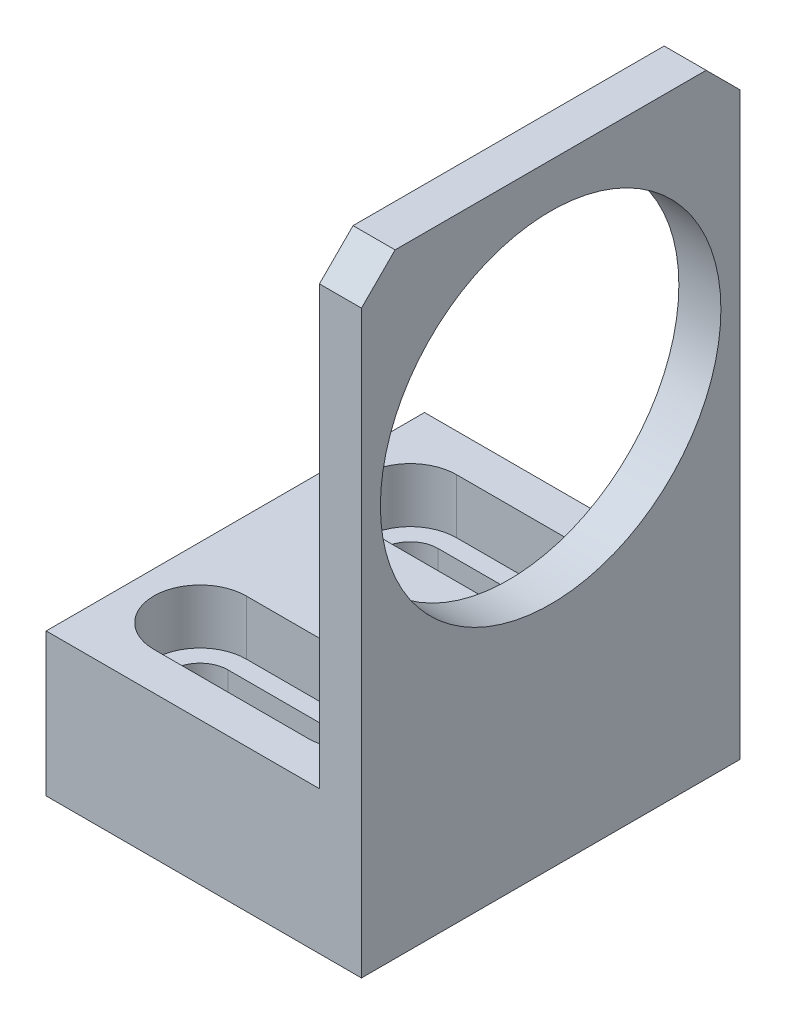
ISO-10303-21;
HEADER;
FILE_DESCRIPTION(('STEP AP214'),'2;1');
FILE_NAME('part.step','',(''),(''),'','','');
FILE_SCHEMA(('AUTOMOTIVE_DESIGN { 1 0 10303 214 1 1 1 1 }'));
ENDSEC;
DATA;
#1=APPLICATION_CONTEXT('core data for automotive mechanical design processes');
#2=APPLICATION_PROTOCOL_DEFINITION('international standard','automotive_design',2000,#1);
#3=PRODUCT_CONTEXT('',#1,'mechanical');
#4=PRODUCT('Part','Part','',(#3));
#5=PRODUCT_RELATED_PRODUCT_CATEGORY('part','',(#4));
#6=PRODUCT_DEFINITION_FORMATION('','',#4);
#7=PRODUCT_DEFINITION_CONTEXT('part definition',#1,'design');
#8=PRODUCT_DEFINITION('design','',#6,#7);
#9=PRODUCT_DEFINITION_SHAPE('','',#8);
#10=(LENGTH_UNIT() NAMED_UNIT(*) SI_UNIT(.MILLI.,.METRE.));
#11=(NAMED_UNIT(*) PLANE_ANGLE_UNIT() SI_UNIT($,.RADIAN.));
#12=(NAMED_UNIT(*) SI_UNIT($,.STERADIAN.) SOLID_ANGLE_UNIT());
#13=UNCERTAINTY_MEASURE_WITH_UNIT(LENGTH_MEASURE(1.E-05),#10,'distance_accuracy_value','');
#14=(GEOMETRIC_REPRESENTATION_CONTEXT(3) GLOBAL_UNCERTAINTY_ASSIGNED_CONTEXT((#13)) GLOBAL_UNIT_ASSIGNED_CONTEXT((#10,
#11,#12)) REPRESENTATION_CONTEXT('',''));
#15=CARTESIAN_POINT('',(0.,0.,0.));
#16=DIRECTION('',(0.,0.,1.));
#17=DIRECTION('',(1.,0.,0.));
#18=AXIS2_PLACEMENT_3D('',#15,#16,#17);
#19=CARTESIAN_POINT('',(0.,0.,0.));
#20=DIRECTION('',(-1.,0.,0.));
#21=DIRECTION('',(0.,0.,1.));
#22=AXIS2_PLACEMENT_3D('',#19,#20,#21);
#23=PLANE('',#22);
#24=CARTESIAN_POINT('',(0.,47.5,0.));
#25=DIRECTION('',(1.,0.,0.));
#26=DIRECTION('',(0.,0.,-1.));
#27=AXIS2_PLACEMENT_3D('',#24,#25,#26);
#28=CIRCLE('',#27,20.25);
#29=CARTESIAN_POINT('',(0.,47.5,-20.25));
#30=VERTEX_POINT('',#29);
#31=EDGE_CURVE('E464',#30,#30,#28,.T.);
#32=ORIENTED_EDGE('',*,*,#31,.T.);
#33=EDGE_LOOP('',(#32));
#34=FACE_BOUND('',#33,.T.);
#35=DIRECTION('',(0.,1.,0.));
#36=VECTOR('',#35,1.);
#37=CARTESIAN_POINT('',(0.,0.,-22.5));
#38=LINE('',#37,#36);
#39=CARTESIAN_POINT('',(0.,17.,-22.5));
#40=VERTEX_POINT('',#39);
#41=CARTESIAN_POINT('',(0.,69.,-22.5));
#42=VERTEX_POINT('',#41);
#43=EDGE_CURVE('E486',#40,#42,#38,.T.);
#44=ORIENTED_EDGE('',*,*,#43,.F.);
#45=DIRECTION('',(0.,0.,1.));
#46=VECTOR('',#45,1.);
#47=CARTESIAN_POINT('',(0.,17.,-22.5));
#48=LINE('',#47,#46);
#49=CARTESIAN_POINT('',(0.,17.,22.5));
#50=VERTEX_POINT('',#49);
#51=EDGE_CURVE('E446',#40,#50,#48,.T.);
#52=ORIENTED_EDGE('',*,*,#51,.T.);
#53=DIRECTION('',(0.,-1.,0.));
#54=VECTOR('',#53,1.);
#55=CARTESIAN_POINT('',(0.,0.,22.5));
#56=LINE('',#55,#54);
#57=CARTESIAN_POINT('',(0.,69.,22.5));
#58=VERTEX_POINT('',#57);
#59=EDGE_CURVE('E469',#58,#50,#56,.T.);
#60=ORIENTED_EDGE('',*,*,#59,.F.);
#61=DIRECTION('',(0.,-0.707106781186546,0.707106781186549));
#62=VECTOR('',#61,1.);
#63=CARTESIAN_POINT('',(0.,45.7500000000002,45.7499999999999));
#64=LINE('',#63,#62);
#65=CARTESIAN_POINT('',(0.,73.,18.5));
#66=VERTEX_POINT('',#65);
#67=EDGE_CURVE('E498',#58,#66,#64,.F.);
#68=ORIENTED_EDGE('',*,*,#67,.T.);
#69=DIRECTION('',(0.,0.,1.));
#70=VECTOR('',#69,1.);
#71=CARTESIAN_POINT('',(0.,73.,22.5));
#72=LINE('',#71,#70);
#73=CARTESIAN_POINT('',(0.,73.,-18.5));
#74=VERTEX_POINT('',#73);
#75=EDGE_CURVE('E475',#74,#66,#72,.T.);
#76=ORIENTED_EDGE('',*,*,#75,.F.);
#77=DIRECTION('',(0.,0.707106781186548,0.707106781186547));
#78=VECTOR('',#77,1.);
#79=CARTESIAN_POINT('',(0.,45.7499999999999,-45.75));
#80=LINE('',#79,#78);
#81=EDGE_CURVE('E500',#74,#42,#80,.F.);
#82=ORIENTED_EDGE('',*,*,#81,.T.);
#83=EDGE_LOOP('',(#44,#52,#60,#68,#76,#82));
#84=FACE_BOUND('',#83,.T.);
#85=ADVANCED_FACE('F187',(#34,#84),#23,.T.);
#86=CARTESIAN_POINT('',(5.,0.,0.));
#87=DIRECTION('',(-1.,0.,0.));
#88=DIRECTION('',(0.,0.,1.));
#89=AXIS2_PLACEMENT_3D('',#86,#87,#88);
#90=PLANE('',#89);
#91=DIRECTION('',(0.,1.,0.));
#92=VECTOR('',#91,1.);
#93=CARTESIAN_POINT('',(5.,0.,-22.5));
#94=LINE('',#93,#92);
#95=CARTESIAN_POINT('',(5.,0.,-22.5));
#96=VERTEX_POINT('',#95);
#97=CARTESIAN_POINT('',(5.,69.,-22.5));
#98=VERTEX_POINT('',#97);
#99=EDGE_CURVE('E477',#96,#98,#94,.T.);
#100=ORIENTED_EDGE('',*,*,#99,.T.);
#101=DIRECTION('',(0.,-0.707106781186548,-0.707106781186547));
#102=VECTOR('',#101,1.);
#103=CARTESIAN_POINT('',(5.,73.,-18.5));
#104=LINE('',#103,#102);
#105=CARTESIAN_POINT('',(5.,73.,-18.5));
#106=VERTEX_POINT('',#105);
#107=EDGE_CURVE('E507',#98,#106,#104,.F.);
#108=ORIENTED_EDGE('',*,*,#107,.T.);
#109=DIRECTION('',(0.,0.,1.));
#110=VECTOR('',#109,1.);
#111=CARTESIAN_POINT('',(5.,73.,22.5));
#112=LINE('',#111,#110);
#113=CARTESIAN_POINT('',(5.,73.,18.5));
#114=VERTEX_POINT('',#113);
#115=EDGE_CURVE('E480',#106,#114,#112,.T.);
#116=ORIENTED_EDGE('',*,*,#115,.T.);
#117=DIRECTION('',(0.,0.707106781186546,-0.707106781186549));
#118=VECTOR('',#117,1.);
#119=CARTESIAN_POINT('',(5.,69.,22.5));
#120=LINE('',#119,#118);
#121=CARTESIAN_POINT('',(5.,69.,22.5));
#122=VERTEX_POINT('',#121);
#123=EDGE_CURVE('E505',#114,#122,#120,.F.);
#124=ORIENTED_EDGE('',*,*,#123,.T.);
#125=DIRECTION('',(0.,-1.,0.));
#126=VECTOR('',#125,1.);
#127=CARTESIAN_POINT('',(5.,0.,22.5));
#128=LINE('',#127,#126);
#129=CARTESIAN_POINT('',(5.,0.,22.5));
#130=VERTEX_POINT('',#129);
#131=EDGE_CURVE('E472',#122,#130,#128,.T.);
#132=ORIENTED_EDGE('',*,*,#131,.T.);
#133=DIRECTION('',(0.,0.,-1.));
#134=VECTOR('',#133,1.);
#135=CARTESIAN_POINT('',(5.,0.,22.5));
#136=LINE('',#135,#134);
#137=EDGE_CURVE('E474',#130,#96,#136,.T.);
#138=ORIENTED_EDGE('',*,*,#137,.T.);
#139=EDGE_LOOP('',(#100,#108,#116,#124,#132,#138));
#140=FACE_BOUND('',#139,.T.);
#141=CARTESIAN_POINT('',(5.,47.5,0.));
#142=DIRECTION('',(1.,0.,0.));
#143=DIRECTION('',(0.,0.,-1.));
#144=AXIS2_PLACEMENT_3D('',#141,#142,#143);
#145=CIRCLE('',#144,20.25);
#146=CARTESIAN_POINT('',(5.,47.5,-20.25));
#147=VERTEX_POINT('',#146);
#148=EDGE_CURVE('E466',#147,#147,#145,.T.);
#149=ORIENTED_EDGE('',*,*,#148,.F.);
#150=EDGE_LOOP('',(#149));
#151=FACE_BOUND('',#150,.T.);
#152=ADVANCED_FACE('F571',(#140,#151),#90,.F.);
#153=CARTESIAN_POINT('',(5.,0.,22.5));
#154=DIRECTION('',(0.,0.,-1.));
#155=DIRECTION('',(-1.,0.,0.));
#156=AXIS2_PLACEMENT_3D('',#153,#154,#155);
#157=PLANE('',#156);
#158=ORIENTED_EDGE('',*,*,#131,.F.);
#159=DIRECTION('',(-1.,0.,0.));
#160=VECTOR('',#159,1.);
#161=CARTESIAN_POINT('',(5.,69.,22.5));
#162=LINE('',#161,#160);
#163=EDGE_CURVE('E509',#122,#58,#162,.T.);
#164=ORIENTED_EDGE('',*,*,#163,.T.);
#165=ORIENTED_EDGE('',*,*,#59,.T.);
#166=DIRECTION('',(1.,0.,0.));
#167=VECTOR('',#166,1.);
#168=CARTESIAN_POINT('',(-32.5,17.,22.5));
#169=LINE('',#168,#167);
#170=CARTESIAN_POINT('',(-32.5,17.,22.5));
#171=VERTEX_POINT('',#170);
#172=EDGE_CURVE('E462',#171,#50,#169,.T.);
#173=ORIENTED_EDGE('',*,*,#172,.F.);
#174=DIRECTION('',(0.,-1.,0.));
#175=VECTOR('',#174,1.);
#176=CARTESIAN_POINT('',(-32.5,17.,22.5));
#177=LINE('',#176,#175);
#178=CARTESIAN_POINT('',(-32.5,0.,22.5));
#179=VERTEX_POINT('',#178);
#180=EDGE_CURVE('E456',#171,#179,#177,.T.);
#181=ORIENTED_EDGE('',*,*,#180,.T.);
#182=DIRECTION('',(-1.,0.,0.));
#183=VECTOR('',#182,1.);
#184=CARTESIAN_POINT('',(5.,0.,22.5));
#185=LINE('',#184,#183);
#186=EDGE_CURVE('E491',#130,#179,#185,.T.);
#187=ORIENTED_EDGE('',*,*,#186,.F.);
#188=EDGE_LOOP('',(#158,#164,#165,#173,#181,#187));
#189=FACE_BOUND('',#188,.T.);
#190=ADVANCED_FACE('F577',(#189),#157,.F.);
#191=CARTESIAN_POINT('',(5.,0.,22.5));
#192=DIRECTION('',(0.,1.,0.));
#193=DIRECTION('',(0.,0.,1.));
#194=AXIS2_PLACEMENT_3D('',#191,#192,#193);
#195=PLANE('',#194);
#196=CARTESIAN_POINT('',(-5.8,0.,-12.5));
#197=DIRECTION('',(0.,1.,0.));
#198=DIRECTION('',(0.,0.,1.));
#199=AXIS2_PLACEMENT_3D('',#196,#197,#198);
#200=CIRCLE('',#199,3.3);
#201=CARTESIAN_POINT('',(-5.8,0.,-9.2));
#202=VERTEX_POINT('',#201);
#203=CARTESIAN_POINT('',(-5.8,0.,-15.8));
#204=VERTEX_POINT('',#203);
#205=EDGE_CURVE('E195',#202,#204,#200,.T.);
#206=ORIENTED_EDGE('',*,*,#205,.T.);
#207=DIRECTION('',(-1.,0.,0.));
#208=VECTOR('',#207,1.);
#209=CARTESIAN_POINT('',(5.,0.,-15.8));
#210=LINE('',#209,#208);
#211=CARTESIAN_POINT('',(-24.2,0.,-15.8));
#212=VERTEX_POINT('',#211);
#213=EDGE_CURVE('E13',#204,#212,#210,.T.);
#214=ORIENTED_EDGE('',*,*,#213,.T.);
#215=CARTESIAN_POINT('',(-24.2,0.,-12.5));
#216=DIRECTION('',(0.,1.,0.));
#217=DIRECTION('',(0.,0.,1.));
#218=AXIS2_PLACEMENT_3D('',#215,#216,#217);
#219=CIRCLE('',#218,3.3);
#220=CARTESIAN_POINT('',(-24.2,0.,-9.2));
#221=VERTEX_POINT('',#220);
#222=EDGE_CURVE('E527',#212,#221,#219,.T.);
#223=ORIENTED_EDGE('',*,*,#222,.T.);
#224=DIRECTION('',(1.,0.,0.));
#225=VECTOR('',#224,1.);
#226=CARTESIAN_POINT('',(5.,0.,-9.20000000000001));
#227=LINE('',#226,#225);
#228=EDGE_CURVE('E524',#221,#202,#227,.T.);
#229=ORIENTED_EDGE('',*,*,#228,.T.);
#230=EDGE_LOOP('',(#206,#214,#223,#229));
#231=FACE_BOUND('',#230,.T.);
#232=CARTESIAN_POINT('',(-5.8,0.,12.5));
#233=DIRECTION('',(0.,1.,0.));
#234=DIRECTION('',(0.,0.,1.));
#235=AXIS2_PLACEMENT_3D('',#232,#233,#234);
#236=CIRCLE('',#235,3.3);
#237=CARTESIAN_POINT('',(-5.8,0.,15.8));
#238=VERTEX_POINT('',#237);
#239=CARTESIAN_POINT('',(-5.8,0.,9.2));
#240=VERTEX_POINT('',#239);
#241=EDGE_CURVE('E518',#238,#240,#236,.T.);
#242=ORIENTED_EDGE('',*,*,#241,.T.);
#243=DIRECTION('',(-1.,0.,0.));
#244=VECTOR('',#243,1.);
#245=CARTESIAN_POINT('',(5.,0.,9.2));
#246=LINE('',#245,#244);
#247=CARTESIAN_POINT('',(-24.2,0.,9.2));
#248=VERTEX_POINT('',#247);
#249=EDGE_CURVE('E521',#240,#248,#246,.T.);
#250=ORIENTED_EDGE('',*,*,#249,.T.);
#251=CARTESIAN_POINT('',(-24.2,0.,12.5));
#252=DIRECTION('',(0.,1.,0.));
#253=DIRECTION('',(0.,0.,1.));
#254=AXIS2_PLACEMENT_3D('',#251,#252,#253);
#255=CIRCLE('',#254,3.3);
#256=CARTESIAN_POINT('',(-24.2,0.,15.8));
#257=VERTEX_POINT('',#256);
#258=EDGE_CURVE('E515',#248,#257,#255,.T.);
#259=ORIENTED_EDGE('',*,*,#258,.T.);
#260=DIRECTION('',(1.,0.,0.));
#261=VECTOR('',#260,1.);
#262=CARTESIAN_POINT('',(5.,0.,15.8));
#263=LINE('',#262,#261);
#264=EDGE_CURVE('E512',#257,#238,#263,.T.);
#265=ORIENTED_EDGE('',*,*,#264,.T.);
#266=EDGE_LOOP('',(#242,#250,#259,#265));
#267=FACE_BOUND('',#266,.T.);
#268=ORIENTED_EDGE('',*,*,#186,.T.);
#269=DIRECTION('',(0.,0.,-1.));
#270=VECTOR('',#269,1.);
#271=CARTESIAN_POINT('',(-32.5,0.,22.5));
#272=LINE('',#271,#270);
#273=CARTESIAN_POINT('',(-32.5,0.,-22.5));
#274=VERTEX_POINT('',#273);
#275=EDGE_CURVE('E447',#179,#274,#272,.T.);
#276=ORIENTED_EDGE('',*,*,#275,.T.);
#277=DIRECTION('',(-1.,0.,0.));
#278=VECTOR('',#277,1.);
#279=CARTESIAN_POINT('',(5.,0.,-22.5));
#280=LINE('',#279,#278);
#281=EDGE_CURVE('E483',#96,#274,#280,.T.);
#282=ORIENTED_EDGE('',*,*,#281,.F.);
#283=ORIENTED_EDGE('',*,*,#137,.F.);
#284=EDGE_LOOP('',(#268,#276,#282,#283));
#285=FACE_BOUND('',#284,.T.);
#286=ADVANCED_FACE('F531',(#231,#267,#285),#195,.F.);
#287=CARTESIAN_POINT('',(5.,0.,-22.5));
#288=DIRECTION('',(0.,0.,1.));
#289=DIRECTION('',(1.,0.,0.));
#290=AXIS2_PLACEMENT_3D('',#287,#288,#289);
#291=PLANE('',#290);
#292=ORIENTED_EDGE('',*,*,#281,.T.);
#293=DIRECTION('',(0.,1.,0.));
#294=VECTOR('',#293,1.);
#295=CARTESIAN_POINT('',(-32.5,0.,-22.5));
#296=LINE('',#295,#294);
#297=CARTESIAN_POINT('',(-32.5,17.,-22.5));
#298=VERTEX_POINT('',#297);
#299=EDGE_CURVE('E450',#274,#298,#296,.T.);
#300=ORIENTED_EDGE('',*,*,#299,.T.);
#301=DIRECTION('',(1.,0.,0.));
#302=VECTOR('',#301,1.);
#303=CARTESIAN_POINT('',(-32.5,17.,-22.5));
#304=LINE('',#303,#302);
#305=EDGE_CURVE('E459',#298,#40,#304,.T.);
#306=ORIENTED_EDGE('',*,*,#305,.T.);
#307=ORIENTED_EDGE('',*,*,#43,.T.);
#308=DIRECTION('',(1.,0.,0.));
#309=VECTOR('',#308,1.);
#310=CARTESIAN_POINT('',(5.,69.,-22.5));
#311=LINE('',#310,#309);
#312=EDGE_CURVE('E503',#42,#98,#311,.T.);
#313=ORIENTED_EDGE('',*,*,#312,.T.);
#314=ORIENTED_EDGE('',*,*,#99,.F.);
#315=EDGE_LOOP('',(#292,#300,#306,#307,#313,#314));
#316=FACE_BOUND('',#315,.T.);
#317=ADVANCED_FACE('F587',(#316),#291,.F.);
#318=CARTESIAN_POINT('',(5.,73.,22.5));
#319=DIRECTION('',(0.,-1.,0.));
#320=DIRECTION('',(0.,0.,-1.));
#321=AXIS2_PLACEMENT_3D('',#318,#319,#320);
#322=PLANE('',#321);
#323=ORIENTED_EDGE('',*,*,#115,.F.);
#324=DIRECTION('',(-1.,0.,0.));
#325=VECTOR('',#324,1.);
#326=CARTESIAN_POINT('',(5.,73.,-18.5));
#327=LINE('',#326,#325);
#328=EDGE_CURVE('E495',#106,#74,#327,.T.);
#329=ORIENTED_EDGE('',*,*,#328,.T.);
#330=ORIENTED_EDGE('',*,*,#75,.T.);
#331=DIRECTION('',(1.,0.,0.));
#332=VECTOR('',#331,1.);
#333=CARTESIAN_POINT('',(5.,73.,18.5));
#334=LINE('',#333,#332);
#335=EDGE_CURVE('E493',#66,#114,#334,.T.);
#336=ORIENTED_EDGE('',*,*,#335,.T.);
#337=EDGE_LOOP('',(#323,#329,#330,#336));
#338=FACE_BOUND('',#337,.T.);
#339=ADVANCED_FACE('F583',(#338),#322,.F.);
#340=CARTESIAN_POINT('',(5.,47.5,0.));
#341=DIRECTION('',(-1.,0.,0.));
#342=DIRECTION('',(0.,0.,1.));
#343=AXIS2_PLACEMENT_3D('',#340,#341,#342);
#344=CYLINDRICAL_SURFACE('',#343,20.25);
#345=ORIENTED_EDGE('',*,*,#148,.T.);
#346=EDGE_LOOP('',(#345));
#347=FACE_BOUND('',#346,.T.);
#348=ORIENTED_EDGE('',*,*,#31,.F.);
#349=EDGE_LOOP('',(#348));
#350=FACE_BOUND('',#349,.T.);
#351=ADVANCED_FACE('F586',(#347,#350),#344,.F.);
#352=CARTESIAN_POINT('',(5.,73.,-18.5));
#353=DIRECTION('',(0.,-0.707106781186547,0.707106781186548));
#354=DIRECTION('',(-1.,0.,0.));
#355=AXIS2_PLACEMENT_3D('',#352,#353,#354);
#356=PLANE('',#355);
#357=ORIENTED_EDGE('',*,*,#107,.F.);
#358=ORIENTED_EDGE('',*,*,#312,.F.);
#359=ORIENTED_EDGE('',*,*,#81,.F.);
#360=ORIENTED_EDGE('',*,*,#328,.F.);
#361=EDGE_LOOP('',(#357,#358,#359,#360));
#362=FACE_BOUND('',#361,.T.);
#363=ADVANCED_FACE('F596',(#362),#356,.F.);
#364=CARTESIAN_POINT('',(5.,69.,22.5));
#365=DIRECTION('',(0.,-0.707106781186549,-0.707106781186546));
#366=DIRECTION('',(-1.,0.,0.));
#367=AXIS2_PLACEMENT_3D('',#364,#365,#366);
#368=PLANE('',#367);
#369=ORIENTED_EDGE('',*,*,#123,.F.);
#370=ORIENTED_EDGE('',*,*,#335,.F.);
#371=ORIENTED_EDGE('',*,*,#67,.F.);
#372=ORIENTED_EDGE('',*,*,#163,.F.);
#373=EDGE_LOOP('',(#369,#370,#371,#372));
#374=FACE_BOUND('',#373,.T.);
#375=ADVANCED_FACE('F189',(#374),#368,.F.);
#376=CARTESIAN_POINT('',(-32.5,17.,-22.5));
#377=DIRECTION('',(0.,1.,0.));
#378=DIRECTION('',(0.,0.,1.));
#379=AXIS2_PLACEMENT_3D('',#376,#377,#378);
#380=PLANE('',#379);
#381=DIRECTION('',(1.,0.,0.));
#382=VECTOR('',#381,1.);
#383=CARTESIAN_POINT('',(-24.2,17.,-7.00000000000003));
#384=LINE('',#383,#382);
#385=CARTESIAN_POINT('',(-24.2,17.,-7.));
#386=VERTEX_POINT('',#385);
#387=CARTESIAN_POINT('',(-5.8,17.,-7.00000000000003));
#388=VERTEX_POINT('',#387);
#389=EDGE_CURVE('E548',#386,#388,#384,.T.);
#390=ORIENTED_EDGE('',*,*,#389,.F.);
#391=CARTESIAN_POINT('',(-24.2,17.,-12.5));
#392=DIRECTION('',(0.,1.,0.));
#393=DIRECTION('',(0.,0.,1.));
#394=AXIS2_PLACEMENT_3D('',#391,#392,#393);
#395=CIRCLE('',#394,5.5);
#396=CARTESIAN_POINT('',(-24.2,17.,-18.));
#397=VERTEX_POINT('',#396);
#398=EDGE_CURVE('E368',#397,#386,#395,.T.);
#399=ORIENTED_EDGE('',*,*,#398,.F.);
#400=DIRECTION('',(1.,0.,0.));
#401=VECTOR('',#400,1.);
#402=CARTESIAN_POINT('',(-24.2,17.,-18.));
#403=LINE('',#402,#401);
#404=CARTESIAN_POINT('',(-5.8,17.,-18.));
#405=VERTEX_POINT('',#404);
#406=EDGE_CURVE('E357',#397,#405,#403,.T.);
#407=ORIENTED_EDGE('',*,*,#406,.T.);
#408=CARTESIAN_POINT('',(-5.8,17.,-12.5));
#409=DIRECTION('',(0.,1.,0.));
#410=DIRECTION('',(0.,0.,1.));
#411=AXIS2_PLACEMENT_3D('',#408,#409,#410);
#412=CIRCLE('',#411,5.5);
#413=EDGE_CURVE('E381',#388,#405,#412,.T.);
#414=ORIENTED_EDGE('',*,*,#413,.F.);
#415=EDGE_LOOP('',(#390,#399,#407,#414));
#416=FACE_BOUND('',#415,.T.);
#417=DIRECTION('',(1.,0.,0.));
#418=VECTOR('',#417,1.);
#419=CARTESIAN_POINT('',(-24.2,17.,18.));
#420=LINE('',#419,#418);
#421=CARTESIAN_POINT('',(-24.2,17.,18.));
#422=VERTEX_POINT('',#421);
#423=CARTESIAN_POINT('',(-5.8,17.,18.));
#424=VERTEX_POINT('',#423);
#425=EDGE_CURVE('E392',#422,#424,#420,.T.);
#426=ORIENTED_EDGE('',*,*,#425,.F.);
#427=CARTESIAN_POINT('',(-24.2,17.,12.5));
#428=DIRECTION('',(0.,1.,0.));
#429=DIRECTION('',(0.,0.,1.));
#430=AXIS2_PLACEMENT_3D('',#427,#428,#429);
#431=CIRCLE('',#430,5.5);
#432=CARTESIAN_POINT('',(-24.2,17.,7.));
#433=VERTEX_POINT('',#432);
#434=EDGE_CURVE('E413',#433,#422,#431,.T.);
#435=ORIENTED_EDGE('',*,*,#434,.F.);
#436=DIRECTION('',(1.,0.,0.));
#437=VECTOR('',#436,1.);
#438=CARTESIAN_POINT('',(-24.2,17.,7.));
#439=LINE('',#438,#437);
#440=CARTESIAN_POINT('',(-5.8,17.,7.));
#441=VERTEX_POINT('',#440);
#442=EDGE_CURVE('E405',#433,#441,#439,.T.);
#443=ORIENTED_EDGE('',*,*,#442,.T.);
#444=CARTESIAN_POINT('',(-5.8,17.,12.5));
#445=DIRECTION('',(0.,1.,0.));
#446=DIRECTION('',(0.,0.,1.));
#447=AXIS2_PLACEMENT_3D('',#444,#445,#446);
#448=CIRCLE('',#447,5.5);
#449=EDGE_CURVE('E432',#424,#441,#448,.T.);
#450=ORIENTED_EDGE('',*,*,#449,.F.);
#451=EDGE_LOOP('',(#426,#435,#443,#450));
#452=FACE_BOUND('',#451,.T.);
#453=ORIENTED_EDGE('',*,*,#51,.F.);
#454=ORIENTED_EDGE('',*,*,#305,.F.);
#455=DIRECTION('',(0.,0.,1.));
#456=VECTOR('',#455,1.);
#457=CARTESIAN_POINT('',(-32.5,17.,-22.5));
#458=LINE('',#457,#456);
#459=EDGE_CURVE('E453',#298,#171,#458,.T.);
#460=ORIENTED_EDGE('',*,*,#459,.T.);
#461=ORIENTED_EDGE('',*,*,#172,.T.);
#462=EDGE_LOOP('',(#453,#454,#460,#461));
#463=FACE_BOUND('',#462,.T.);
#464=ADVANCED_FACE('F603',(#416,#452,#463),#380,.T.);
#465=CARTESIAN_POINT('',(-32.5,0.,0.));
#466=DIRECTION('',(1.,0.,0.));
#467=DIRECTION('',(0.,0.,-1.));
#468=AXIS2_PLACEMENT_3D('',#465,#466,#467);
#469=PLANE('',#468);
#470=ORIENTED_EDGE('',*,*,#275,.F.);
#471=ORIENTED_EDGE('',*,*,#180,.F.);
#472=ORIENTED_EDGE('',*,*,#459,.F.);
#473=ORIENTED_EDGE('',*,*,#299,.F.);
#474=EDGE_LOOP('',(#470,#471,#472,#473));
#475=FACE_BOUND('',#474,.T.);
#476=ADVANCED_FACE('F626',(#475),#469,.F.);
#477=CARTESIAN_POINT('',(-5.8,17.,12.5));
#478=DIRECTION('',(0.,1.,0.));
#479=DIRECTION('',(0.,0.,1.));
#480=AXIS2_PLACEMENT_3D('',#477,#478,#479);
#481=CYLINDRICAL_SURFACE('',#480,3.3);
#482=DIRECTION('',(0.,1.,0.));
#483=VECTOR('',#482,1.);
#484=CARTESIAN_POINT('',(-5.8,17.,15.8));
#485=LINE('',#484,#483);
#486=CARTESIAN_POINT('',(-5.8,10.5,15.8));
#487=VERTEX_POINT('',#486);
#488=EDGE_CURVE('E429',#487,#238,#485,.F.);
#489=ORIENTED_EDGE('',*,*,#488,.F.);
#490=CARTESIAN_POINT('',(-5.8,10.5,12.5));
#491=DIRECTION('',(0.,1.,0.));
#492=DIRECTION('',(0.,0.,1.));
#493=AXIS2_PLACEMENT_3D('',#490,#491,#492);
#494=CIRCLE('',#493,3.3);
#495=CARTESIAN_POINT('',(-5.8,10.5,9.2));
#496=VERTEX_POINT('',#495);
#497=EDGE_CURVE('E438',#487,#496,#494,.T.);
#498=ORIENTED_EDGE('',*,*,#497,.T.);
#499=DIRECTION('',(0.,1.,0.));
#500=VECTOR('',#499,1.);
#501=CARTESIAN_POINT('',(-5.8,17.,9.2));
#502=LINE('',#501,#500);
#503=EDGE_CURVE('E427',#240,#496,#502,.T.);
#504=ORIENTED_EDGE('',*,*,#503,.F.);
#505=ORIENTED_EDGE('',*,*,#241,.F.);
#506=EDGE_LOOP('',(#489,#498,#504,#505));
#507=FACE_BOUND('',#506,.T.);
#508=ADVANCED_FACE('F637',(#507),#481,.F.);
#509=CARTESIAN_POINT('',(-2.5,10.5,12.5));
#510=DIRECTION('',(0.,-1.,0.));
#511=DIRECTION('',(0.,0.,-1.));
#512=AXIS2_PLACEMENT_3D('',#509,#510,#511);
#513=PLANE('',#512);
#514=DIRECTION('',(1.,0.,0.));
#515=VECTOR('',#514,1.);
#516=CARTESIAN_POINT('',(-24.2,10.5,15.8));
#517=LINE('',#516,#515);
#518=CARTESIAN_POINT('',(-24.2,10.5,15.8));
#519=VERTEX_POINT('',#518);
#520=EDGE_CURVE('E397',#519,#487,#517,.T.);
#521=ORIENTED_EDGE('',*,*,#520,.F.);
#522=CARTESIAN_POINT('',(-24.2,10.5,12.5));
#523=DIRECTION('',(0.,1.,0.));
#524=DIRECTION('',(0.,0.,1.));
#525=AXIS2_PLACEMENT_3D('',#522,#523,#524);
#526=CIRCLE('',#525,3.3);
#527=CARTESIAN_POINT('',(-24.2,10.5,9.2));
#528=VERTEX_POINT('',#527);
#529=EDGE_CURVE('E419',#528,#519,#526,.T.);
#530=ORIENTED_EDGE('',*,*,#529,.F.);
#531=DIRECTION('',(1.,0.,0.));
#532=VECTOR('',#531,1.);
#533=CARTESIAN_POINT('',(-24.2,10.5,9.2));
#534=LINE('',#533,#532);
#535=EDGE_CURVE('E400',#528,#496,#534,.T.);
#536=ORIENTED_EDGE('',*,*,#535,.T.);
#537=ORIENTED_EDGE('',*,*,#497,.F.);
#538=EDGE_LOOP('',(#521,#530,#536,#537));
#539=FACE_BOUND('',#538,.T.);
#540=CARTESIAN_POINT('',(-5.8,10.5,12.5));
#541=DIRECTION('',(0.,1.,0.));
#542=DIRECTION('',(0.,0.,1.));
#543=AXIS2_PLACEMENT_3D('',#540,#541,#542);
#544=CIRCLE('',#543,5.5);
#545=CARTESIAN_POINT('',(-5.8,10.5,18.));
#546=VERTEX_POINT('',#545);
#547=CARTESIAN_POINT('',(-5.8,10.5,7.));
#548=VERTEX_POINT('',#547);
#549=EDGE_CURVE('E435',#546,#548,#544,.T.);
#550=ORIENTED_EDGE('',*,*,#549,.T.);
#551=DIRECTION('',(1.,0.,0.));
#552=VECTOR('',#551,1.);
#553=CARTESIAN_POINT('',(-24.2,10.5,7.));
#554=LINE('',#553,#552);
#555=CARTESIAN_POINT('',(-24.2,10.5,7.));
#556=VERTEX_POINT('',#555);
#557=EDGE_CURVE('E403',#556,#548,#554,.T.);
#558=ORIENTED_EDGE('',*,*,#557,.F.);
#559=CARTESIAN_POINT('',(-24.2,10.5,12.5));
#560=DIRECTION('',(0.,1.,0.));
#561=DIRECTION('',(0.,0.,1.));
#562=AXIS2_PLACEMENT_3D('',#559,#560,#561);
#563=CIRCLE('',#562,5.5);
#564=CARTESIAN_POINT('',(-24.2,10.5,18.));
#565=VERTEX_POINT('',#564);
#566=EDGE_CURVE('E416',#556,#565,#563,.T.);
#567=ORIENTED_EDGE('',*,*,#566,.T.);
#568=DIRECTION('',(1.,0.,0.));
#569=VECTOR('',#568,1.);
#570=CARTESIAN_POINT('',(-24.2,10.5,18.));
#571=LINE('',#570,#569);
#572=EDGE_CURVE('E394',#565,#546,#571,.T.);
#573=ORIENTED_EDGE('',*,*,#572,.T.);
#574=EDGE_LOOP('',(#550,#558,#567,#573));
#575=FACE_BOUND('',#574,.T.);
#576=ADVANCED_FACE('F644',(#539,#575),#513,.F.);
#577=CARTESIAN_POINT('',(-5.8,17.,12.5));
#578=DIRECTION('',(0.,1.,0.));
#579=DIRECTION('',(0.,0.,1.));
#580=AXIS2_PLACEMENT_3D('',#577,#578,#579);
#581=CYLINDRICAL_SURFACE('',#580,5.5);
#582=ORIENTED_EDGE('',*,*,#549,.F.);
#583=DIRECTION('',(0.,1.,0.));
#584=VECTOR('',#583,1.);
#585=CARTESIAN_POINT('',(-5.8,17.,18.));
#586=LINE('',#585,#584);
#587=EDGE_CURVE('E443',#424,#546,#586,.F.);
#588=ORIENTED_EDGE('',*,*,#587,.F.);
#589=ORIENTED_EDGE('',*,*,#449,.T.);
#590=DIRECTION('',(0.,1.,0.));
#591=VECTOR('',#590,1.);
#592=CARTESIAN_POINT('',(-5.8,17.,7.));
#593=LINE('',#592,#591);
#594=EDGE_CURVE('E441',#548,#441,#593,.T.);
#595=ORIENTED_EDGE('',*,*,#594,.F.);
#596=EDGE_LOOP('',(#582,#588,#589,#595));
#597=FACE_BOUND('',#596,.T.);
#598=ADVANCED_FACE('F648',(#597),#581,.F.);
#599=CARTESIAN_POINT('',(-24.2,17.,12.5));
#600=DIRECTION('',(0.,1.,0.));
#601=DIRECTION('',(0.,0.,1.));
#602=AXIS2_PLACEMENT_3D('',#599,#600,#601);
#603=CYLINDRICAL_SURFACE('',#602,3.3);
#604=DIRECTION('',(0.,1.,0.));
#605=VECTOR('',#604,1.);
#606=CARTESIAN_POINT('',(-24.2,17.,9.2));
#607=LINE('',#606,#605);
#608=EDGE_CURVE('E410',#528,#248,#607,.F.);
#609=ORIENTED_EDGE('',*,*,#608,.F.);
#610=ORIENTED_EDGE('',*,*,#529,.T.);
#611=DIRECTION('',(0.,1.,0.));
#612=VECTOR('',#611,1.);
#613=CARTESIAN_POINT('',(-24.2,17.,15.8));
#614=LINE('',#613,#612);
#615=EDGE_CURVE('E408',#257,#519,#614,.T.);
#616=ORIENTED_EDGE('',*,*,#615,.F.);
#617=ORIENTED_EDGE('',*,*,#258,.F.);
#618=EDGE_LOOP('',(#609,#610,#616,#617));
#619=FACE_BOUND('',#618,.T.);
#620=ADVANCED_FACE('F652',(#619),#603,.F.);
#621=CARTESIAN_POINT('',(-24.2,17.,12.5));
#622=DIRECTION('',(0.,1.,0.));
#623=DIRECTION('',(0.,0.,1.));
#624=AXIS2_PLACEMENT_3D('',#621,#622,#623);
#625=CYLINDRICAL_SURFACE('',#624,5.5);
#626=ORIENTED_EDGE('',*,*,#434,.T.);
#627=DIRECTION('',(0.,1.,0.));
#628=VECTOR('',#627,1.);
#629=CARTESIAN_POINT('',(-24.2,17.,18.));
#630=LINE('',#629,#628);
#631=EDGE_CURVE('E422',#565,#422,#630,.T.);
#632=ORIENTED_EDGE('',*,*,#631,.F.);
#633=ORIENTED_EDGE('',*,*,#566,.F.);
#634=DIRECTION('',(0.,1.,0.));
#635=VECTOR('',#634,1.);
#636=CARTESIAN_POINT('',(-24.2,17.,7.));
#637=LINE('',#636,#635);
#638=EDGE_CURVE('E424',#433,#556,#637,.F.);
#639=ORIENTED_EDGE('',*,*,#638,.F.);
#640=EDGE_LOOP('',(#626,#632,#633,#639));
#641=FACE_BOUND('',#640,.T.);
#642=ADVANCED_FACE('F656',(#641),#625,.F.);
#643=CARTESIAN_POINT('',(-24.2,17.,7.));
#644=DIRECTION('',(0.,0.,-1.));
#645=DIRECTION('',(-1.,0.,0.));
#646=AXIS2_PLACEMENT_3D('',#643,#644,#645);
#647=PLANE('',#646);
#648=ORIENTED_EDGE('',*,*,#594,.T.);
#649=ORIENTED_EDGE('',*,*,#442,.F.);
#650=ORIENTED_EDGE('',*,*,#638,.T.);
#651=ORIENTED_EDGE('',*,*,#557,.T.);
#652=EDGE_LOOP('',(#648,#649,#650,#651));
#653=FACE_BOUND('',#652,.T.);
#654=ADVANCED_FACE('F660',(#653),#647,.F.);
#655=CARTESIAN_POINT('',(-24.2,17.,9.2));
#656=DIRECTION('',(0.,0.,-1.));
#657=DIRECTION('',(-1.,0.,0.));
#658=AXIS2_PLACEMENT_3D('',#655,#656,#657);
#659=PLANE('',#658);
#660=ORIENTED_EDGE('',*,*,#503,.T.);
#661=ORIENTED_EDGE('',*,*,#535,.F.);
#662=ORIENTED_EDGE('',*,*,#608,.T.);
#663=ORIENTED_EDGE('',*,*,#249,.F.);
#664=EDGE_LOOP('',(#660,#661,#662,#663));
#665=FACE_BOUND('',#664,.T.);
#666=ADVANCED_FACE('F664',(#665),#659,.F.);
#667=CARTESIAN_POINT('',(-24.2,17.,15.8));
#668=DIRECTION('',(0.,0.,1.));
#669=DIRECTION('',(1.,0.,0.));
#670=AXIS2_PLACEMENT_3D('',#667,#668,#669);
#671=PLANE('',#670);
#672=ORIENTED_EDGE('',*,*,#615,.T.);
#673=ORIENTED_EDGE('',*,*,#520,.T.);
#674=ORIENTED_EDGE('',*,*,#488,.T.);
#675=ORIENTED_EDGE('',*,*,#264,.F.);
#676=EDGE_LOOP('',(#672,#673,#674,#675));
#677=FACE_BOUND('',#676,.T.);
#678=ADVANCED_FACE('F668',(#677),#671,.F.);
#679=CARTESIAN_POINT('',(-24.2,17.,18.));
#680=DIRECTION('',(0.,0.,1.));
#681=DIRECTION('',(1.,0.,0.));
#682=AXIS2_PLACEMENT_3D('',#679,#680,#681);
#683=PLANE('',#682);
#684=ORIENTED_EDGE('',*,*,#587,.T.);
#685=ORIENTED_EDGE('',*,*,#572,.F.);
#686=ORIENTED_EDGE('',*,*,#631,.T.);
#687=ORIENTED_EDGE('',*,*,#425,.T.);
#688=EDGE_LOOP('',(#684,#685,#686,#687));
#689=FACE_BOUND('',#688,.T.);
#690=ADVANCED_FACE('F568',(#689),#683,.F.);
#691=CARTESIAN_POINT('',(-5.8,17.,-12.5));
#692=DIRECTION('',(0.,1.,0.));
#693=DIRECTION('',(0.,0.,1.));
#694=AXIS2_PLACEMENT_3D('',#691,#692,#693);
#695=CYLINDRICAL_SURFACE('',#694,3.3);
#696=DIRECTION('',(0.,1.,0.));
#697=VECTOR('',#696,1.);
#698=CARTESIAN_POINT('',(-5.8,17.,-9.2));
#699=LINE('',#698,#697);
#700=CARTESIAN_POINT('',(-5.8,10.5,-9.2));
#701=VERTEX_POINT('',#700);
#702=EDGE_CURVE('E378',#701,#202,#699,.F.);
#703=ORIENTED_EDGE('',*,*,#702,.F.);
#704=CARTESIAN_POINT('',(-5.8,10.5,-12.5));
#705=DIRECTION('',(0.,1.,0.));
#706=DIRECTION('',(0.,0.,1.));
#707=AXIS2_PLACEMENT_3D('',#704,#705,#706);
#708=CIRCLE('',#707,3.3);
#709=CARTESIAN_POINT('',(-5.8,10.5,-15.8));
#710=VERTEX_POINT('',#709);
#711=EDGE_CURVE('E385',#701,#710,#708,.T.);
#712=ORIENTED_EDGE('',*,*,#711,.T.);
#713=DIRECTION('',(0.,1.,0.));
#714=VECTOR('',#713,1.);
#715=CARTESIAN_POINT('',(-5.8,17.,-15.8));
#716=LINE('',#715,#714);
#717=EDGE_CURVE('E210',#204,#710,#716,.T.);
#718=ORIENTED_EDGE('',*,*,#717,.F.);
#719=ORIENTED_EDGE('',*,*,#205,.F.);
#720=EDGE_LOOP('',(#703,#712,#718,#719));
#721=FACE_BOUND('',#720,.T.);
#722=ADVANCED_FACE('F534',(#721),#695,.F.);
#723=CARTESIAN_POINT('',(-2.5,10.5,-12.5));
#724=DIRECTION('',(0.,-1.,0.));
#725=DIRECTION('',(0.,0.,-1.));
#726=AXIS2_PLACEMENT_3D('',#723,#724,#725);
#727=PLANE('',#726);
#728=DIRECTION('',(1.,0.,0.));
#729=VECTOR('',#728,1.);
#730=CARTESIAN_POINT('',(-24.2,10.5,-9.2));
#731=LINE('',#730,#729);
#732=CARTESIAN_POINT('',(-24.2,10.5,-9.2));
#733=VERTEX_POINT('',#732);
#734=EDGE_CURVE('E540',#733,#701,#731,.T.);
#735=ORIENTED_EDGE('',*,*,#734,.F.);
#736=CARTESIAN_POINT('',(-24.2,10.5,-12.5));
#737=DIRECTION('',(0.,1.,0.));
#738=DIRECTION('',(0.,0.,1.));
#739=AXIS2_PLACEMENT_3D('',#736,#737,#738);
#740=CIRCLE('',#739,3.3);
#741=CARTESIAN_POINT('',(-24.2,10.5,-15.8));
#742=VERTEX_POINT('',#741);
#743=EDGE_CURVE('E367',#742,#733,#740,.T.);
#744=ORIENTED_EDGE('',*,*,#743,.F.);
#745=DIRECTION('',(1.,0.,0.));
#746=VECTOR('',#745,1.);
#747=CARTESIAN_POINT('',(-24.2,10.5,-15.8));
#748=LINE('',#747,#746);
#749=EDGE_CURVE('E358',#742,#710,#748,.T.);
#750=ORIENTED_EDGE('',*,*,#749,.T.);
#751=ORIENTED_EDGE('',*,*,#711,.F.);
#752=EDGE_LOOP('',(#735,#744,#750,#751));
#753=FACE_BOUND('',#752,.T.);
#754=CARTESIAN_POINT('',(-5.8,10.5,-12.5));
#755=DIRECTION('',(0.,1.,0.));
#756=DIRECTION('',(0.,0.,1.));
#757=AXIS2_PLACEMENT_3D('',#754,#755,#756);
#758=CIRCLE('',#757,5.5);
#759=CARTESIAN_POINT('',(-5.8,10.5,-7.));
#760=VERTEX_POINT('',#759);
#761=CARTESIAN_POINT('',(-5.8,10.5,-18.));
#762=VERTEX_POINT('',#761);
#763=EDGE_CURVE('E354',#760,#762,#758,.T.);
#764=ORIENTED_EDGE('',*,*,#763,.T.);
#765=DIRECTION('',(1.,0.,0.));
#766=VECTOR('',#765,1.);
#767=CARTESIAN_POINT('',(-24.2,10.5,-18.));
#768=LINE('',#767,#766);
#769=CARTESIAN_POINT('',(-24.2,10.5,-18.));
#770=VERTEX_POINT('',#769);
#771=EDGE_CURVE('E350',#770,#762,#768,.T.);
#772=ORIENTED_EDGE('',*,*,#771,.F.);
#773=CARTESIAN_POINT('',(-24.2,10.5,-12.5));
#774=DIRECTION('',(0.,1.,0.));
#775=DIRECTION('',(0.,0.,1.));
#776=AXIS2_PLACEMENT_3D('',#773,#774,#775);
#777=CIRCLE('',#776,5.5);
#778=CARTESIAN_POINT('',(-24.2,10.5,-7.));
#779=VERTEX_POINT('',#778);
#780=EDGE_CURVE('E353',#770,#779,#777,.T.);
#781=ORIENTED_EDGE('',*,*,#780,.T.);
#782=DIRECTION('',(1.,0.,0.));
#783=VECTOR('',#782,1.);
#784=CARTESIAN_POINT('',(-24.2,10.5,-7.));
#785=LINE('',#784,#783);
#786=EDGE_CURVE('E544',#779,#760,#785,.T.);
#787=ORIENTED_EDGE('',*,*,#786,.T.);
#788=EDGE_LOOP('',(#764,#772,#781,#787));
#789=FACE_BOUND('',#788,.T.);
#790=ADVANCED_FACE('F351',(#753,#789),#727,.F.);
#791=CARTESIAN_POINT('',(-5.8,17.,-12.5));
#792=DIRECTION('',(0.,1.,0.));
#793=DIRECTION('',(0.,0.,1.));
#794=AXIS2_PLACEMENT_3D('',#791,#792,#793);
#795=CYLINDRICAL_SURFACE('',#794,5.5);
#796=ORIENTED_EDGE('',*,*,#763,.F.);
#797=DIRECTION('',(0.,1.,0.));
#798=VECTOR('',#797,1.);
#799=CARTESIAN_POINT('',(-5.8,17.,-7.));
#800=LINE('',#799,#798);
#801=EDGE_CURVE('E389',#388,#760,#800,.F.);
#802=ORIENTED_EDGE('',*,*,#801,.F.);
#803=ORIENTED_EDGE('',*,*,#413,.T.);
#804=DIRECTION('',(0.,1.,0.));
#805=VECTOR('',#804,1.);
#806=CARTESIAN_POINT('',(-5.8,17.,-18.));
#807=LINE('',#806,#805);
#808=EDGE_CURVE('E387',#762,#405,#807,.T.);
#809=ORIENTED_EDGE('',*,*,#808,.F.);
#810=EDGE_LOOP('',(#796,#802,#803,#809));
#811=FACE_BOUND('',#810,.T.);
#812=ADVANCED_FACE('F560',(#811),#795,.F.);
#813=CARTESIAN_POINT('',(-24.2,17.,-12.5));
#814=DIRECTION('',(0.,1.,0.));
#815=DIRECTION('',(0.,0.,1.));
#816=AXIS2_PLACEMENT_3D('',#813,#814,#815);
#817=CYLINDRICAL_SURFACE('',#816,3.3);
#818=DIRECTION('',(0.,1.,0.));
#819=VECTOR('',#818,1.);
#820=CARTESIAN_POINT('',(-24.2,17.,-15.8));
#821=LINE('',#820,#819);
#822=EDGE_CURVE('E372',#742,#212,#821,.F.);
#823=ORIENTED_EDGE('',*,*,#822,.F.);
#824=ORIENTED_EDGE('',*,*,#743,.T.);
#825=DIRECTION('',(0.,1.,0.));
#826=VECTOR('',#825,1.);
#827=CARTESIAN_POINT('',(-24.2,17.,-9.2));
#828=LINE('',#827,#826);
#829=EDGE_CURVE('E541',#221,#733,#828,.T.);
#830=ORIENTED_EDGE('',*,*,#829,.F.);
#831=ORIENTED_EDGE('',*,*,#222,.F.);
#832=EDGE_LOOP('',(#823,#824,#830,#831));
#833=FACE_BOUND('',#832,.T.);
#834=ADVANCED_FACE('F558',(#833),#817,.F.);
#835=CARTESIAN_POINT('',(-24.2,17.,-12.5));
#836=DIRECTION('',(0.,1.,0.));
#837=DIRECTION('',(0.,0.,1.));
#838=AXIS2_PLACEMENT_3D('',#835,#836,#837);
#839=CYLINDRICAL_SURFACE('',#838,5.5);
#840=ORIENTED_EDGE('',*,*,#398,.T.);
#841=DIRECTION('',(0.,1.,0.));
#842=VECTOR('',#841,1.);
#843=CARTESIAN_POINT('',(-24.2,17.,-7.));
#844=LINE('',#843,#842);
#845=EDGE_CURVE('E363',#779,#386,#844,.T.);
#846=ORIENTED_EDGE('',*,*,#845,.F.);
#847=ORIENTED_EDGE('',*,*,#780,.F.);
#848=DIRECTION('',(0.,1.,0.));
#849=VECTOR('',#848,1.);
#850=CARTESIAN_POINT('',(-24.2,17.,-18.));
#851=LINE('',#850,#849);
#852=EDGE_CURVE('E202',#397,#770,#851,.F.);
#853=ORIENTED_EDGE('',*,*,#852,.F.);
#854=EDGE_LOOP('',(#840,#846,#847,#853));
#855=FACE_BOUND('',#854,.T.);
#856=ADVANCED_FACE('F366',(#855),#839,.F.);
#857=CARTESIAN_POINT('',(-24.2,17.,-18.));
#858=DIRECTION('',(0.,0.,-1.));
#859=DIRECTION('',(-1.,0.,0.));
#860=AXIS2_PLACEMENT_3D('',#857,#858,#859);
#861=PLANE('',#860);
#862=ORIENTED_EDGE('',*,*,#808,.T.);
#863=ORIENTED_EDGE('',*,*,#406,.F.);
#864=ORIENTED_EDGE('',*,*,#852,.T.);
#865=ORIENTED_EDGE('',*,*,#771,.T.);
#866=EDGE_LOOP('',(#862,#863,#864,#865));
#867=FACE_BOUND('',#866,.T.);
#868=ADVANCED_FACE('F360',(#867),#861,.F.);
#869=CARTESIAN_POINT('',(-24.2,17.,-15.8));
#870=DIRECTION('',(0.,0.,-1.));
#871=DIRECTION('',(-1.,0.,0.));
#872=AXIS2_PLACEMENT_3D('',#869,#870,#871);
#873=PLANE('',#872);
#874=ORIENTED_EDGE('',*,*,#717,.T.);
#875=ORIENTED_EDGE('',*,*,#749,.F.);
#876=ORIENTED_EDGE('',*,*,#822,.T.);
#877=ORIENTED_EDGE('',*,*,#213,.F.);
#878=EDGE_LOOP('',(#874,#875,#876,#877));
#879=FACE_BOUND('',#878,.T.);
#880=ADVANCED_FACE('F556',(#879),#873,.F.);
#881=CARTESIAN_POINT('',(-24.2,17.,-9.2));
#882=DIRECTION('',(0.,0.,1.));
#883=DIRECTION('',(1.,0.,0.));
#884=AXIS2_PLACEMENT_3D('',#881,#882,#883);
#885=PLANE('',#884);
#886=ORIENTED_EDGE('',*,*,#829,.T.);
#887=ORIENTED_EDGE('',*,*,#734,.T.);
#888=ORIENTED_EDGE('',*,*,#702,.T.);
#889=ORIENTED_EDGE('',*,*,#228,.F.);
#890=EDGE_LOOP('',(#886,#887,#888,#889));
#891=FACE_BOUND('',#890,.T.);
#892=ADVANCED_FACE('F537',(#891),#885,.F.);
#893=CARTESIAN_POINT('',(-24.2,17.,-7.));
#894=DIRECTION('',(0.,0.,1.));
#895=DIRECTION('',(1.,0.,0.));
#896=AXIS2_PLACEMENT_3D('',#893,#894,#895);
#897=PLANE('',#896);
#898=ORIENTED_EDGE('',*,*,#801,.T.);
#899=ORIENTED_EDGE('',*,*,#786,.F.);
#900=ORIENTED_EDGE('',*,*,#845,.T.);
#901=ORIENTED_EDGE('',*,*,#389,.T.);
#902=EDGE_LOOP('',(#898,#899,#900,#901));
#903=FACE_BOUND('',#902,.T.);
#904=ADVANCED_FACE('F743',(#903),#897,.F.);
#905=CLOSED_SHELL('',(#85,#152,#190,#286,#317,#339,#351,#363,#375,#464,#476,#508,#576,#598,#620,
#642,#654,#666,#678,#690,#722,#790,#812,#834,#856,#868,#880,#892,#904));
#906=MANIFOLD_SOLID_BREP('B2',#905);
#907=ADVANCED_BREP_SHAPE_REPRESENTATION('',(#18,#906),#14);
#908=SHAPE_DEFINITION_REPRESENTATION(#9,#907);
ENDSEC;
END-ISO-10303-21;
